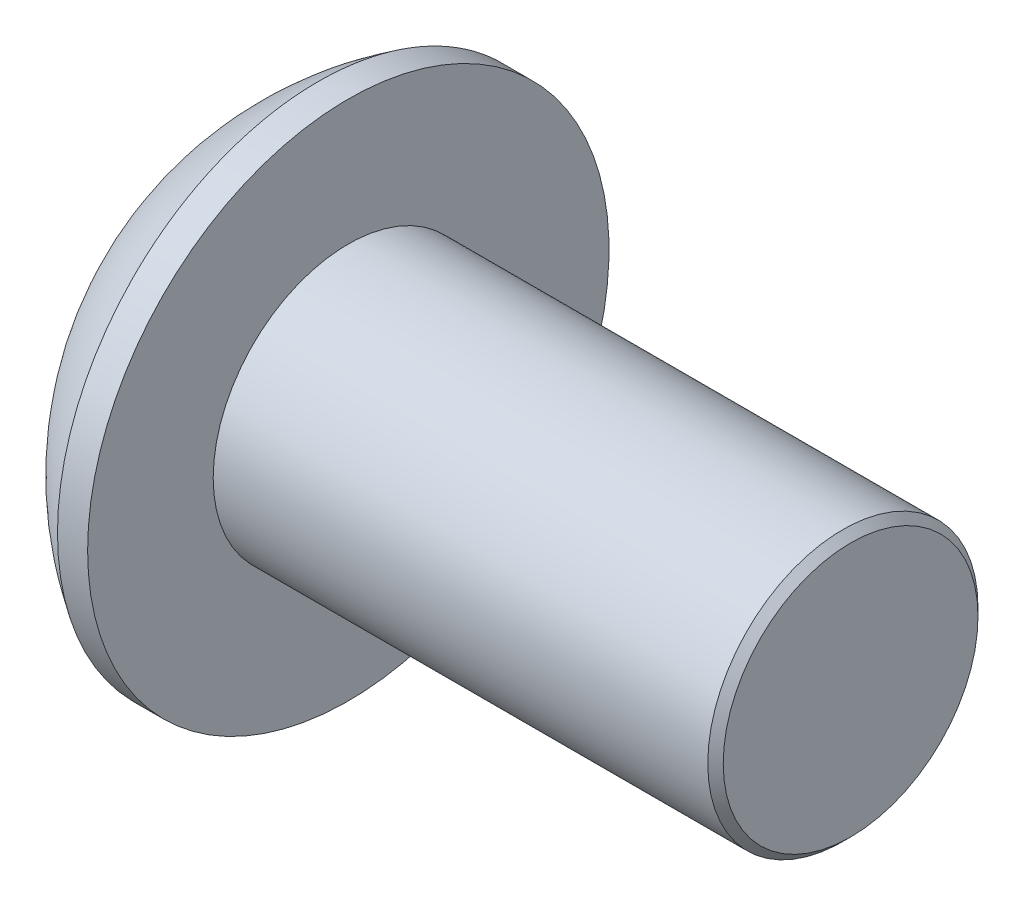
ISO-10303-21;
HEADER;
FILE_DESCRIPTION(('STEP AP214'),'2;1');
FILE_NAME('part.step','',(''),(''),'','','');
FILE_SCHEMA(('AUTOMOTIVE_DESIGN { 1 0 10303 214 1 1 1 1 }'));
ENDSEC;
DATA;
#1=APPLICATION_CONTEXT('core data for automotive mechanical design processes');
#2=APPLICATION_PROTOCOL_DEFINITION('international standard','automotive_design',2000,#1);
#3=PRODUCT_CONTEXT('',#1,'mechanical');
#4=PRODUCT('Part','Part','',(#3));
#5=PRODUCT_RELATED_PRODUCT_CATEGORY('part','',(#4));
#6=PRODUCT_DEFINITION_FORMATION('','',#4);
#7=PRODUCT_DEFINITION_CONTEXT('part definition',#1,'design');
#8=PRODUCT_DEFINITION('design','',#6,#7);
#9=PRODUCT_DEFINITION_SHAPE('','',#8);
#10=(LENGTH_UNIT() NAMED_UNIT(*) SI_UNIT(.MILLI.,.METRE.));
#11=(NAMED_UNIT(*) PLANE_ANGLE_UNIT() SI_UNIT($,.RADIAN.));
#12=(NAMED_UNIT(*) SI_UNIT($,.STERADIAN.) SOLID_ANGLE_UNIT());
#13=UNCERTAINTY_MEASURE_WITH_UNIT(LENGTH_MEASURE(1.E-05),#10,'distance_accuracy_value','');
#14=(GEOMETRIC_REPRESENTATION_CONTEXT(3) GLOBAL_UNCERTAINTY_ASSIGNED_CONTEXT((#13)) GLOBAL_UNIT_ASSIGNED_CONTEXT((#10,
#11,#12)) REPRESENTATION_CONTEXT('',''));
#15=CARTESIAN_POINT('',(0.,0.,0.));
#16=DIRECTION('',(0.,0.,1.));
#17=DIRECTION('',(1.,0.,0.));
#18=AXIS2_PLACEMENT_3D('',#15,#16,#17);
#19=CARTESIAN_POINT('',(1.32080000000034,0.,0.));
#20=DIRECTION('',(-1.,0.,0.));
#21=DIRECTION('',(0.,0.,1.));
#22=AXIS2_PLACEMENT_3D('',#19,#20,#21);
#23=CONICAL_SURFACE('',#22,1.1937999999998,1.04719755119608);
#24=CARTESIAN_POINT('',(2.01004075135902,0.,4.44089209850063E-13));
#25=VERTEX_POINT('',#24);
#26=VERTEX_LOOP('',#25);
#27=FACE_BOUND('',#26,.T.);
#28=CARTESIAN_POINT('',(1.32080000000009,0.,0.));
#29=DIRECTION('',(-1.,0.,0.));
#30=DIRECTION('',(0.,0.,1.));
#31=AXIS2_PLACEMENT_3D('',#28,#29,#30);
#32=CIRCLE('',#31,1.19380000000024);
#33=CARTESIAN_POINT('',(1.32080000000004,-1.03386112703797,0.59690000000006));
#34=VERTEX_POINT('',#33);
#35=CARTESIAN_POINT('',(1.32080000000004,0.,1.19380000000012));
#36=VERTEX_POINT('',#35);
#37=EDGE_CURVE('E19',#34,#36,#32,.T.);
#38=ORIENTED_EDGE('',*,*,#37,.T.);
#39=CARTESIAN_POINT('',(1.32080000000009,0.,0.));
#40=DIRECTION('',(-1.,0.,0.));
#41=DIRECTION('',(0.,0.,1.));
#42=AXIS2_PLACEMENT_3D('',#39,#40,#41);
#43=CIRCLE('',#42,1.19380000000024);
#44=CARTESIAN_POINT('',(1.32080000000004,1.03386112703797,0.596900000000061));
#45=VERTEX_POINT('',#44);
#46=EDGE_CURVE('E147',#36,#45,#43,.T.);
#47=ORIENTED_EDGE('',*,*,#46,.T.);
#48=CARTESIAN_POINT('',(1.32080000000009,0.,0.));
#49=DIRECTION('',(-1.,0.,0.));
#50=DIRECTION('',(0.,0.,1.));
#51=AXIS2_PLACEMENT_3D('',#48,#49,#50);
#52=CIRCLE('',#51,1.19380000000024);
#53=CARTESIAN_POINT('',(1.32080000000004,1.03386112703797,-0.596900000000061));
#54=VERTEX_POINT('',#53);
#55=EDGE_CURVE('E449',#45,#54,#52,.T.);
#56=ORIENTED_EDGE('',*,*,#55,.T.);
#57=CARTESIAN_POINT('',(1.32080000000009,0.,0.));
#58=DIRECTION('',(-1.,0.,0.));
#59=DIRECTION('',(0.,0.,1.));
#60=AXIS2_PLACEMENT_3D('',#57,#58,#59);
#61=CIRCLE('',#60,1.19380000000024);
#62=CARTESIAN_POINT('',(1.32080000000004,1.49457637585666E-12,-1.19380000000012));
#63=VERTEX_POINT('',#62);
#64=EDGE_CURVE('E450',#54,#63,#61,.T.);
#65=ORIENTED_EDGE('',*,*,#64,.T.);
#66=CARTESIAN_POINT('',(1.32080000000009,0.,0.));
#67=DIRECTION('',(-1.,0.,0.));
#68=DIRECTION('',(0.,0.,1.));
#69=AXIS2_PLACEMENT_3D('',#66,#67,#68);
#70=CIRCLE('',#69,1.19380000000024);
#71=CARTESIAN_POINT('',(1.32080000000004,-1.03386112703797,-0.596900000000061));
#72=VERTEX_POINT('',#71);
#73=EDGE_CURVE('E92',#63,#72,#70,.T.);
#74=ORIENTED_EDGE('',*,*,#73,.T.);
#75=CARTESIAN_POINT('',(1.32080000000009,0.,0.));
#76=DIRECTION('',(-1.,0.,0.));
#77=DIRECTION('',(0.,0.,1.));
#78=AXIS2_PLACEMENT_3D('',#75,#76,#77);
#79=CIRCLE('',#78,1.19380000000024);
#80=EDGE_CURVE('E88',#72,#34,#79,.T.);
#81=ORIENTED_EDGE('',*,*,#80,.T.);
#82=EDGE_LOOP('',(#38,#47,#56,#65,#74,#81));
#83=FACE_BOUND('',#82,.T.);
#84=ADVANCED_FACE('F16',(#27,#83),#23,.F.);
#85=CARTESIAN_POINT('',(1.3208,-2.06772225407573,-1.1938));
#86=DIRECTION('',(1.,0.,0.));
#87=DIRECTION('',(0.,0.,-1.));
#88=AXIS2_PLACEMENT_3D('',#85,#86,#87);
#89=PLANE('',#88);
#90=DIRECTION('',(0.,0.5,0.866025403784439));
#91=VECTOR('',#90,1.);
#92=CARTESIAN_POINT('',(1.3208,-1.37848150271715,0.));
#93=LINE('',#92,#91);
#94=CARTESIAN_POINT('',(1.3208,-0.689240751358575,1.1938));
#95=VERTEX_POINT('',#94);
#96=EDGE_CURVE('E100',#95,#34,#93,.F.);
#97=ORIENTED_EDGE('',*,*,#96,.F.);
#98=DIRECTION('',(0.,1.,0.));
#99=VECTOR('',#98,1.);
#100=CARTESIAN_POINT('',(1.3208,-0.689240751358575,1.1938));
#101=LINE('',#100,#99);
#102=EDGE_CURVE('E102',#36,#95,#101,.F.);
#103=ORIENTED_EDGE('',*,*,#102,.F.);
#104=ORIENTED_EDGE('',*,*,#37,.F.);
#105=EDGE_LOOP('',(#97,#103,#104));
#106=FACE_BOUND('',#105,.T.);
#107=ADVANCED_FACE('F98',(#106),#89,.F.);
#108=CARTESIAN_POINT('',(1.3208,-2.06772225407573,-1.1938));
#109=DIRECTION('',(1.,0.,0.));
#110=DIRECTION('',(0.,0.,-1.));
#111=AXIS2_PLACEMENT_3D('',#108,#109,#110);
#112=PLANE('',#111);
#113=DIRECTION('',(0.,-0.5,0.866025403784439));
#114=VECTOR('',#113,1.);
#115=CARTESIAN_POINT('',(1.3208,-0.689240751358575,-1.1938));
#116=LINE('',#115,#114);
#117=CARTESIAN_POINT('',(1.3208,-1.37848150271715,0.));
#118=VERTEX_POINT('',#117);
#119=EDGE_CURVE('E108',#118,#72,#116,.F.);
#120=ORIENTED_EDGE('',*,*,#119,.F.);
#121=DIRECTION('',(0.,0.5,0.866025403784439));
#122=VECTOR('',#121,1.);
#123=CARTESIAN_POINT('',(1.3208,-1.37848150271715,0.));
#124=LINE('',#123,#122);
#125=EDGE_CURVE('E105',#34,#118,#124,.F.);
#126=ORIENTED_EDGE('',*,*,#125,.F.);
#127=ORIENTED_EDGE('',*,*,#80,.F.);
#128=EDGE_LOOP('',(#120,#126,#127));
#129=FACE_BOUND('',#128,.T.);
#130=ADVANCED_FACE('F106',(#129),#112,.F.);
#131=CARTESIAN_POINT('',(1.3208,-2.06772225407573,-1.1938));
#132=DIRECTION('',(1.,0.,0.));
#133=DIRECTION('',(0.,0.,-1.));
#134=AXIS2_PLACEMENT_3D('',#131,#132,#133);
#135=PLANE('',#134);
#136=DIRECTION('',(0.,1.,0.));
#137=VECTOR('',#136,1.);
#138=CARTESIAN_POINT('',(1.3208,0.689240751358575,-1.1938));
#139=LINE('',#138,#137);
#140=CARTESIAN_POINT('',(1.3208,-0.689240751358575,-1.1938));
#141=VERTEX_POINT('',#140);
#142=EDGE_CURVE('E420',#141,#63,#139,.T.);
#143=ORIENTED_EDGE('',*,*,#142,.F.);
#144=DIRECTION('',(0.,-0.5,0.866025403784439));
#145=VECTOR('',#144,1.);
#146=CARTESIAN_POINT('',(1.3208,-0.689240751358575,-1.1938));
#147=LINE('',#146,#145);
#148=EDGE_CURVE('E432',#72,#141,#147,.F.);
#149=ORIENTED_EDGE('',*,*,#148,.F.);
#150=ORIENTED_EDGE('',*,*,#73,.F.);
#151=EDGE_LOOP('',(#143,#149,#150));
#152=FACE_BOUND('',#151,.T.);
#153=ADVANCED_FACE('F190',(#152),#135,.F.);
#154=CARTESIAN_POINT('',(1.3208,-2.06772225407573,-1.1938));
#155=DIRECTION('',(1.,0.,0.));
#156=DIRECTION('',(0.,0.,-1.));
#157=AXIS2_PLACEMENT_3D('',#154,#155,#156);
#158=PLANE('',#157);
#159=DIRECTION('',(0.,-0.5,-0.866025403784439));
#160=VECTOR('',#159,1.);
#161=CARTESIAN_POINT('',(1.3208,1.37848150271715,0.));
#162=LINE('',#161,#160);
#163=CARTESIAN_POINT('',(1.3208,0.689240751358575,-1.1938));
#164=VERTEX_POINT('',#163);
#165=EDGE_CURVE('E406',#164,#54,#162,.F.);
#166=ORIENTED_EDGE('',*,*,#165,.F.);
#167=DIRECTION('',(0.,1.,0.));
#168=VECTOR('',#167,1.);
#169=CARTESIAN_POINT('',(1.3208,0.689240751358575,-1.1938));
#170=LINE('',#169,#168);
#171=EDGE_CURVE('E417',#63,#164,#170,.T.);
#172=ORIENTED_EDGE('',*,*,#171,.F.);
#173=ORIENTED_EDGE('',*,*,#64,.F.);
#174=EDGE_LOOP('',(#166,#172,#173));
#175=FACE_BOUND('',#174,.T.);
#176=ADVANCED_FACE('F186',(#175),#158,.F.);
#177=CARTESIAN_POINT('',(1.3208,-2.06772225407573,-1.1938));
#178=DIRECTION('',(1.,0.,0.));
#179=DIRECTION('',(0.,0.,-1.));
#180=AXIS2_PLACEMENT_3D('',#177,#178,#179);
#181=PLANE('',#180);
#182=DIRECTION('',(0.,0.5,-0.866025403784439));
#183=VECTOR('',#182,1.);
#184=CARTESIAN_POINT('',(1.3208,0.689240751358575,1.1938));
#185=LINE('',#184,#183);
#186=CARTESIAN_POINT('',(1.3208,1.37848150271715,0.));
#187=VERTEX_POINT('',#186);
#188=EDGE_CURVE('E385',#187,#45,#185,.F.);
#189=ORIENTED_EDGE('',*,*,#188,.F.);
#190=DIRECTION('',(0.,-0.5,-0.866025403784439));
#191=VECTOR('',#190,1.);
#192=CARTESIAN_POINT('',(1.3208,1.37848150271715,0.));
#193=LINE('',#192,#191);
#194=EDGE_CURVE('E404',#54,#187,#193,.F.);
#195=ORIENTED_EDGE('',*,*,#194,.F.);
#196=ORIENTED_EDGE('',*,*,#55,.F.);
#197=EDGE_LOOP('',(#189,#195,#196));
#198=FACE_BOUND('',#197,.T.);
#199=ADVANCED_FACE('F182',(#198),#181,.F.);
#200=CARTESIAN_POINT('',(1.3208,-2.06772225407573,-1.1938));
#201=DIRECTION('',(1.,0.,0.));
#202=DIRECTION('',(0.,0.,-1.));
#203=AXIS2_PLACEMENT_3D('',#200,#201,#202);
#204=PLANE('',#203);
#205=DIRECTION('',(0.,1.,0.));
#206=VECTOR('',#205,1.);
#207=CARTESIAN_POINT('',(1.3208,-0.689240751358575,1.1938));
#208=LINE('',#207,#206);
#209=CARTESIAN_POINT('',(1.3208,0.689240751358575,1.1938));
#210=VERTEX_POINT('',#209);
#211=EDGE_CURVE('E117',#210,#36,#208,.F.);
#212=ORIENTED_EDGE('',*,*,#211,.F.);
#213=DIRECTION('',(0.,0.5,-0.866025403784439));
#214=VECTOR('',#213,1.);
#215=CARTESIAN_POINT('',(1.3208,0.689240751358575,1.1938));
#216=LINE('',#215,#214);
#217=EDGE_CURVE('E388',#45,#210,#216,.F.);
#218=ORIENTED_EDGE('',*,*,#217,.F.);
#219=ORIENTED_EDGE('',*,*,#46,.F.);
#220=EDGE_LOOP('',(#212,#218,#219));
#221=FACE_BOUND('',#220,.T.);
#222=ADVANCED_FACE('F178',(#221),#204,.F.);
#223=CARTESIAN_POINT('',(1.3208,-0.689240751358575,1.1938));
#224=DIRECTION('',(0.,0.,-1.));
#225=DIRECTION('',(0.,1.,0.));
#226=AXIS2_PLACEMENT_3D('',#223,#224,#225);
#227=PLANE('',#226);
#228=DIRECTION('',(0.,1.,0.));
#229=VECTOR('',#228,1.);
#230=CARTESIAN_POINT('',(0.,0.,1.1938));
#231=LINE('',#230,#229);
#232=CARTESIAN_POINT('',(0.,0.689240751358575,1.1938));
#233=VERTEX_POINT('',#232);
#234=CARTESIAN_POINT('',(0.,-0.689240751358575,1.1938));
#235=VERTEX_POINT('',#234);
#236=EDGE_CURVE('E382',#233,#235,#231,.F.);
#237=ORIENTED_EDGE('',*,*,#236,.F.);
#238=DIRECTION('',(1.,0.,0.));
#239=VECTOR('',#238,1.);
#240=CARTESIAN_POINT('',(1.3208,0.689240751358575,1.1938));
#241=LINE('',#240,#239);
#242=EDGE_CURVE('E394',#210,#233,#241,.F.);
#243=ORIENTED_EDGE('',*,*,#242,.F.);
#244=ORIENTED_EDGE('',*,*,#211,.T.);
#245=ORIENTED_EDGE('',*,*,#102,.T.);
#246=DIRECTION('',(1.,0.,0.));
#247=VECTOR('',#246,1.);
#248=CARTESIAN_POINT('',(1.3208,-0.689240751358575,1.1938));
#249=LINE('',#248,#247);
#250=EDGE_CURVE('E111',#235,#95,#249,.T.);
#251=ORIENTED_EDGE('',*,*,#250,.F.);
#252=EDGE_LOOP('',(#237,#243,#244,#245,#251));
#253=FACE_BOUND('',#252,.T.);
#254=ADVANCED_FACE('F175',(#253),#227,.T.);
#255=CARTESIAN_POINT('',(1.3208,-1.37848150271715,0.));
#256=DIRECTION('',(0.,0.866025403784439,-0.5));
#257=DIRECTION('',(0.,0.5,0.866025403784439));
#258=AXIS2_PLACEMENT_3D('',#255,#256,#257);
#259=PLANE('',#258);
#260=DIRECTION('',(0.,-0.5,-0.866025403784439));
#261=VECTOR('',#260,1.);
#262=CARTESIAN_POINT('',(0.,-0.689240751358575,1.1938));
#263=LINE('',#262,#261);
#264=CARTESIAN_POINT('',(0.,-1.37848150271715,0.));
#265=VERTEX_POINT('',#264);
#266=EDGE_CURVE('E379',#235,#265,#263,.T.);
#267=ORIENTED_EDGE('',*,*,#266,.F.);
#268=ORIENTED_EDGE('',*,*,#250,.T.);
#269=ORIENTED_EDGE('',*,*,#96,.T.);
#270=ORIENTED_EDGE('',*,*,#125,.T.);
#271=DIRECTION('',(1.,0.,0.));
#272=VECTOR('',#271,1.);
#273=CARTESIAN_POINT('',(1.3208,-1.37848150271715,0.));
#274=LINE('',#273,#272);
#275=EDGE_CURVE('E429',#265,#118,#274,.T.);
#276=ORIENTED_EDGE('',*,*,#275,.F.);
#277=EDGE_LOOP('',(#267,#268,#269,#270,#276));
#278=FACE_BOUND('',#277,.T.);
#279=ADVANCED_FACE('F115',(#278),#259,.T.);
#280=CARTESIAN_POINT('',(1.3208,-0.689240751358575,-1.1938));
#281=DIRECTION('',(0.,0.866025403784439,0.5));
#282=DIRECTION('',(0.,-0.5,0.866025403784439));
#283=AXIS2_PLACEMENT_3D('',#280,#281,#282);
#284=PLANE('',#283);
#285=DIRECTION('',(0.,0.5,-0.866025403784439));
#286=VECTOR('',#285,1.);
#287=CARTESIAN_POINT('',(0.,-1.37848150271715,0.));
#288=LINE('',#287,#286);
#289=CARTESIAN_POINT('',(0.,-0.689240751358575,-1.1938));
#290=VERTEX_POINT('',#289);
#291=EDGE_CURVE('E376',#265,#290,#288,.T.);
#292=ORIENTED_EDGE('',*,*,#291,.F.);
#293=ORIENTED_EDGE('',*,*,#275,.T.);
#294=ORIENTED_EDGE('',*,*,#119,.T.);
#295=ORIENTED_EDGE('',*,*,#148,.T.);
#296=DIRECTION('',(1.,0.,0.));
#297=VECTOR('',#296,1.);
#298=CARTESIAN_POINT('',(1.3208,-0.689240751358575,-1.1938));
#299=LINE('',#298,#297);
#300=EDGE_CURVE('E414',#290,#141,#299,.T.);
#301=ORIENTED_EDGE('',*,*,#300,.F.);
#302=EDGE_LOOP('',(#292,#293,#294,#295,#301));
#303=FACE_BOUND('',#302,.T.);
#304=ADVANCED_FACE('F168',(#303),#284,.T.);
#305=CARTESIAN_POINT('',(1.3208,0.689240751358575,-1.1938));
#306=DIRECTION('',(0.,0.,1.));
#307=DIRECTION('',(1.,0.,0.));
#308=AXIS2_PLACEMENT_3D('',#305,#306,#307);
#309=PLANE('',#308);
#310=DIRECTION('',(0.,1.,0.));
#311=VECTOR('',#310,1.);
#312=CARTESIAN_POINT('',(0.,0.,-1.1938));
#313=LINE('',#312,#311);
#314=CARTESIAN_POINT('',(0.,0.689240751358575,-1.1938));
#315=VERTEX_POINT('',#314);
#316=EDGE_CURVE('E373',#290,#315,#313,.T.);
#317=ORIENTED_EDGE('',*,*,#316,.F.);
#318=ORIENTED_EDGE('',*,*,#300,.T.);
#319=ORIENTED_EDGE('',*,*,#142,.T.);
#320=ORIENTED_EDGE('',*,*,#171,.T.);
#321=DIRECTION('',(1.,0.,0.));
#322=VECTOR('',#321,1.);
#323=CARTESIAN_POINT('',(1.3208,0.689240751358575,-1.1938));
#324=LINE('',#323,#322);
#325=EDGE_CURVE('E389',#315,#164,#324,.T.);
#326=ORIENTED_EDGE('',*,*,#325,.F.);
#327=EDGE_LOOP('',(#317,#318,#319,#320,#326));
#328=FACE_BOUND('',#327,.T.);
#329=ADVANCED_FACE('F165',(#328),#309,.T.);
#330=CARTESIAN_POINT('',(1.3208,1.37848150271715,0.));
#331=DIRECTION('',(0.,-0.866025403784439,0.5));
#332=DIRECTION('',(0.,-0.5,-0.866025403784439));
#333=AXIS2_PLACEMENT_3D('',#330,#331,#332);
#334=PLANE('',#333);
#335=DIRECTION('',(0.,0.5,0.866025403784439));
#336=VECTOR('',#335,1.);
#337=CARTESIAN_POINT('',(0.,0.689240751358575,-1.1938));
#338=LINE('',#337,#336);
#339=CARTESIAN_POINT('',(0.,1.37848150271715,0.));
#340=VERTEX_POINT('',#339);
#341=EDGE_CURVE('E370',#315,#340,#338,.T.);
#342=ORIENTED_EDGE('',*,*,#341,.F.);
#343=ORIENTED_EDGE('',*,*,#325,.T.);
#344=ORIENTED_EDGE('',*,*,#165,.T.);
#345=ORIENTED_EDGE('',*,*,#194,.T.);
#346=DIRECTION('',(1.,0.,0.));
#347=VECTOR('',#346,1.);
#348=CARTESIAN_POINT('',(1.3208,1.37848150271715,0.));
#349=LINE('',#348,#347);
#350=EDGE_CURVE('E34',#340,#187,#349,.T.);
#351=ORIENTED_EDGE('',*,*,#350,.F.);
#352=EDGE_LOOP('',(#342,#343,#344,#345,#351));
#353=FACE_BOUND('',#352,.T.);
#354=ADVANCED_FACE('F161',(#353),#334,.T.);
#355=CARTESIAN_POINT('',(1.3208,0.689240751358575,1.1938));
#356=DIRECTION('',(0.,-0.866025403784439,-0.5));
#357=DIRECTION('',(0.,0.5,-0.866025403784439));
#358=AXIS2_PLACEMENT_3D('',#355,#356,#357);
#359=PLANE('',#358);
#360=DIRECTION('',(0.,-0.5,0.866025403784439));
#361=VECTOR('',#360,1.);
#362=CARTESIAN_POINT('',(0.,1.37848150271715,0.));
#363=LINE('',#362,#361);
#364=EDGE_CURVE('E146',#340,#233,#363,.T.);
#365=ORIENTED_EDGE('',*,*,#364,.F.);
#366=ORIENTED_EDGE('',*,*,#350,.T.);
#367=ORIENTED_EDGE('',*,*,#188,.T.);
#368=ORIENTED_EDGE('',*,*,#217,.T.);
#369=ORIENTED_EDGE('',*,*,#242,.T.);
#370=EDGE_LOOP('',(#365,#366,#367,#368,#369));
#371=FACE_BOUND('',#370,.T.);
#372=ADVANCED_FACE('F157',(#371),#359,.T.);
#373=CARTESIAN_POINT('',(0.,0.,0.));
#374=DIRECTION('',(-1.,0.,0.));
#375=DIRECTION('',(0.,0.,1.));
#376=AXIS2_PLACEMENT_3D('',#373,#374,#375);
#377=PLANE('',#376);
#378=ORIENTED_EDGE('',*,*,#341,.T.);
#379=ORIENTED_EDGE('',*,*,#364,.T.);
#380=ORIENTED_EDGE('',*,*,#236,.T.);
#381=ORIENTED_EDGE('',*,*,#266,.T.);
#382=ORIENTED_EDGE('',*,*,#291,.T.);
#383=ORIENTED_EDGE('',*,*,#316,.T.);
#384=EDGE_LOOP('',(#378,#379,#380,#381,#382,#383));
#385=FACE_BOUND('',#384,.T.);
#386=CARTESIAN_POINT('',(0.,1.647825,0.));
#387=CARTESIAN_POINT('',(1.63519156892115E-13,1.64781976319874,0.0924902039777532));
#388=CARTESIAN_POINT('',(1.3280260282674E-13,1.63999511633709,0.18514501432637));
#389=CARTESIAN_POINT('',(0.,1.6167119250047,0.322075808080014));
#390=CARTESIAN_POINT('',(-1.58318794569898E-13,1.60700618770234,0.367435533396361));
#391=CARTESIAN_POINT('',(1.5888139631505E-13,1.58380101865853,0.457220935695141));
#392=CARTESIAN_POINT('',(5.68557833423821E-13,1.57029850831031,0.501645823115264));
#393=CARTESIAN_POINT('',(9.3616121179063E-13,1.52428156574313,0.632817459278968));
#394=CARTESIAN_POINT('',(0.,1.48621992666366,0.717681965518643));
#395=CARTESIAN_POINT('',(0.,1.39637079695658,0.879809706624016));
#396=CARTESIAN_POINT('',(7.82242536497637E-13,1.34458278455109,0.957072652379996));
#397=CARTESIAN_POINT('',(4.86953568155855E-13,1.25777784714522,1.06558770210238));
#398=CARTESIAN_POINT('',(1.33447060642817E-13,1.22729946114794,1.10054993332365));
#399=CARTESIAN_POINT('',(-1.32884925775019E-13,1.16354004969107,1.16775237388221));
#400=CARTESIAN_POINT('',(0.,1.13026175473033,1.19999517515816));
#401=CARTESIAN_POINT('',(0.,1.02649304340867,1.29236218866442));
#402=CARTESIAN_POINT('',(0.,0.952049986714079,1.34814848277713));
#403=CARTESIAN_POINT('',(0.,0.794895196754069,1.44639825105766));
#404=CARTESIAN_POINT('',(0.,0.712183775431297,1.48886222758992));
#405=CARTESIAN_POINT('',(0.,0.54079662426573,1.55930919813143));
#406=CARTESIAN_POINT('',(0.,0.452120958135286,1.58729234680269));
#407=CARTESIAN_POINT('',(0.,0.271332331080317,1.62797191307414));
#408=CARTESIAN_POINT('',(0.,0.179219351801789,1.64066824903626));
#409=CARTESIAN_POINT('',(0.,-0.00583077027840882,1.65041748705409));
#410=CARTESIAN_POINT('',(0.,-0.0987679130800783,1.64747038910979));
#411=CARTESIAN_POINT('',(0.,-0.282830196388826,1.62601274134436));
#412=CARTESIAN_POINT('',(0.,-0.37395534657002,1.60750227463794));
#413=CARTESIAN_POINT('',(0.,-0.551796068178806,1.55545413364524));
#414=CARTESIAN_POINT('',(0.,-0.638511592498167,1.52191629885844));
#415=CARTESIAN_POINT('',(0.,-0.805120175533155,1.44072378052347));
#416=CARTESIAN_POINT('',(0.,-0.885012976819958,1.39306856461393));
#417=CARTESIAN_POINT('',(0.,-0.997912879588362,1.31211658756413));
#418=CARTESIAN_POINT('',(0.,-1.0343949246834,1.28354906167735));
#419=CARTESIAN_POINT('',(0.,-1.10486279842069,1.2234182930371));
#420=CARTESIAN_POINT('',(0.,-1.13884618403291,1.19185218578118));
#421=CARTESIAN_POINT('',(0.,-1.23657300939909,1.09305906467359));
#422=CARTESIAN_POINT('',(0.,-1.29619288399357,1.02166556658613));
#423=CARTESIAN_POINT('',(0.,-1.40258050817756,0.869876423478036));
#424=CARTESIAN_POINT('',(0.,-1.44934874627767,0.789481120793481));
#425=CARTESIAN_POINT('',(0.,-1.50889406070376,0.663870959313344));
#426=CARTESIAN_POINT('',(0.,-1.52698985473587,0.621110806760431));
#427=CARTESIAN_POINT('',(0.,-1.55950093966665,0.534260776864334));
#428=CARTESIAN_POINT('',(-1.04973140146496E-13,-1.57391920916438,0.490172008203172));
#429=CARTESIAN_POINT('',(2.10045254706393E-13,-1.6114617790958,0.356445777718599));
#430=CARTESIAN_POINT('',(1.14250083706093E-12,-1.62897899568075,0.265126085962908));
#431=CARTESIAN_POINT('',(4.34054466733687E-13,-1.64174347214909,0.144386595969389));
#432=CARTESIAN_POINT('',(1.21340306256601E-13,-1.64402207668917,0.115560405797875));
#433=CARTESIAN_POINT('',(-1.20906625387681E-13,-1.64706365940121,0.0578281757252701));
#434=CARTESIAN_POINT('',(0.,-1.64782663757319,0.0289221358241782));
#435=CARTESIAN_POINT('',(1.64941431812562E-13,-1.64781976319875,-0.0924902039777541));
#436=CARTESIAN_POINT('',(1.33069267383729E-13,-1.6399951163371,-0.185145014326371));
#437=CARTESIAN_POINT('',(0.,-1.61671192500471,-0.322075808080015));
#438=CARTESIAN_POINT('',(-1.58362753759592E-13,-1.60700618770235,-0.367435533396362));
#439=CARTESIAN_POINT('',(1.58925391252273E-13,-1.58380101865854,-0.457220935695142));
#440=CARTESIAN_POINT('',(5.68599984465805E-13,-1.57029850831032,-0.501645823115265));
#441=CARTESIAN_POINT('',(9.360771106357E-13,-1.52428156574314,-0.632817459278968));
#442=CARTESIAN_POINT('',(0.,-1.48621992666367,-0.717681965518644));
#443=CARTESIAN_POINT('',(0.,-1.39637079695659,-0.879809706624018));
#444=CARTESIAN_POINT('',(7.83473156940465E-13,-1.3445827845511,-0.957072652379998));
#445=CARTESIAN_POINT('',(4.87639062539118E-13,-1.25777784714523,-1.06558770210238));
#446=CARTESIAN_POINT('',(1.33633557334351E-13,-1.22729946114795,-1.10054993332365));
#447=CARTESIAN_POINT('',(-1.33071242655653E-13,-1.16354004969107,-1.16775237388221));
#448=CARTESIAN_POINT('',(0.,-1.13026175473034,-1.19999517515816));
#449=CARTESIAN_POINT('',(0.,-1.02649304340868,-1.29236218866442));
#450=CARTESIAN_POINT('',(0.,-0.95204998671409,-1.34814848277713));
#451=CARTESIAN_POINT('',(0.,-0.79489519675408,-1.44639825105766));
#452=CARTESIAN_POINT('',(0.,-0.712183775431308,-1.48886222758992));
#453=CARTESIAN_POINT('',(0.,-0.540796624265741,-1.55930919813143));
#454=CARTESIAN_POINT('',(0.,-0.452120958135297,-1.58729234680269));
#455=CARTESIAN_POINT('',(0.,-0.271332331080327,-1.62797191307414));
#456=CARTESIAN_POINT('',(0.,-0.179219351801799,-1.64066824903626));
#457=CARTESIAN_POINT('',(0.,0.00583077027839878,-1.65041748705409));
#458=CARTESIAN_POINT('',(0.,0.0987679130800683,-1.64747038910979));
#459=CARTESIAN_POINT('',(0.,0.282830196388816,-1.62601274134436));
#460=CARTESIAN_POINT('',(0.,0.37395534657001,-1.60750227463795));
#461=CARTESIAN_POINT('',(0.,0.551796068178796,-1.55545413364524));
#462=CARTESIAN_POINT('',(0.,0.638511592498158,-1.52191629885844));
#463=CARTESIAN_POINT('',(0.,0.805120175533146,-1.44072378052347));
#464=CARTESIAN_POINT('',(0.,0.885012976819948,-1.39306856461394));
#465=CARTESIAN_POINT('',(0.,0.997912879588351,-1.31211658756413));
#466=CARTESIAN_POINT('',(0.,1.03439492468339,-1.28354906167735));
#467=CARTESIAN_POINT('',(0.,1.10486279842068,-1.2234182930371));
#468=CARTESIAN_POINT('',(0.,1.1388461840329,-1.19185218578118));
#469=CARTESIAN_POINT('',(0.,1.23657300939908,-1.09305906467359));
#470=CARTESIAN_POINT('',(0.,1.29619288399356,-1.02166556658613));
#471=CARTESIAN_POINT('',(0.,1.40258050817755,-0.869876423478035));
#472=CARTESIAN_POINT('',(0.,1.44934874627766,-0.789481120793481));
#473=CARTESIAN_POINT('',(0.,1.50889406070375,-0.663870959313343));
#474=CARTESIAN_POINT('',(0.,1.52698985473586,-0.62111080676043));
#475=CARTESIAN_POINT('',(0.,1.55950093966664,-0.534260776864333));
#476=CARTESIAN_POINT('',(-1.0525400134382E-13,1.57391920916438,-0.49017200820317));
#477=CARTESIAN_POINT('',(2.10605504450137E-13,1.61146177909579,-0.356445777718598));
#478=CARTESIAN_POINT('',(1.14555106174587E-12,1.62897899568074,-0.265126085962907));
#479=CARTESIAN_POINT('',(4.3537782659486E-13,1.64174347214909,-0.144386595969388));
#480=CARTESIAN_POINT('',(1.21880186581217E-13,1.64402207668916,-0.115560405797875));
#481=CARTESIAN_POINT('',(-1.21446505712297E-13,1.6470636594012,-0.0578281757252703));
#482=CARTESIAN_POINT('',(0.,1.64782663757318,-0.0289221358241787));
#483=CARTESIAN_POINT('',(0.,1.647825,0.));
#484=B_SPLINE_CURVE_WITH_KNOTS('',3,(#386,#387,#388,#389,#390,#391,#392,#393,#394,#395,#396,
#397,#398,#399,#400,#401,#402,#403,#404,#405,#406,#407,#408,#409,#410,#411,#412,#413,#414,#415,
#416,#417,#418,#419,#420,#421,#422,#423,#424,#425,#426,#427,#428,#429,#430,#431,#432,#433,#434,
#435,#436,#437,#438,#439,#440,#441,#442,#443,#444,#445,#446,#447,#448,#449,#450,#451,#452,#453,
#454,#455,#456,#457,#458,#459,#460,#461,#462,#463,#464,#465,#466,#467,#468,#469,#470,#471,#472,
#473,#474,#475,#476,#477,#478,#479,#480,#481,#482,#483),.UNSPECIFIED.,.T.,.F.,(4,2,2,2,2,2,2,2,
2,2,2,2,2,2,2,2,2,2,2,2,2,2,2,2,2,2,2,2,2,2,2,2,2,2,2,2,2,2,2,2,2,2,2,2,2,2,2,2,4),(0.,
0.277336029422427,0.416368541537112,0.555514114625601,0.833141970294988,1.11078038089036,
1.24978149120748,1.38864858351854,1.66629367015056,1.94392828594775,2.22155993641642,
2.49919306954938,2.77682620268235,3.05445785315102,3.33209246894821,3.60973755557991,
3.74860464789075,3.88760575820768,4.16524416880333,4.44287202447289,4.58201759756162,
4.72105010967663,4.99838613909884,5.08511046196678,5.17183478483478,5.44917081425721,
5.58820332637189,5.72734889946038,6.00497675512977,6.28261516572515,6.42161627604226,
6.56048336835333,6.83812845498534,7.11576307078253,7.39339472125121,7.67102785438416,
7.94866098751713,8.2262926379858,8.50392725378299,8.78157234041469,8.92043943272553,
9.05944054304246,9.33707895363812,9.61470680930767,9.7538523823964,9.89288489451142,
10.1702209239336,10.2569452468016,10.3436695696696),.UNSPECIFIED.);
#485=CARTESIAN_POINT('',(0.,1.647825,0.));
#486=VERTEX_POINT('',#485);
#487=EDGE_CURVE('E139',#486,#486,#484,.T.);
#488=ORIENTED_EDGE('',*,*,#487,.F.);
#489=EDGE_LOOP('',(#488));
#490=FACE_BOUND('',#489,.T.);
#491=ADVANCED_FACE('F153',(#385,#490),#377,.T.);
#492=CARTESIAN_POINT('',(3.50132362607759,0.,0.));
#493=DIRECTION('',(0.,1.,0.));
#494=DIRECTION('',(1.,0.,0.));
#495=AXIS2_PLACEMENT_3D('',#492,#493,#494);
#496=SPHERICAL_SURFACE('',#495,3.86970210289554);
#497=CARTESIAN_POINT('',(1.4732,0.,0.));
#498=DIRECTION('',(-1.,0.,0.));
#499=DIRECTION('',(0.,0.,1.));
#500=AXIS2_PLACEMENT_3D('',#497,#498,#499);
#501=CIRCLE('',#500,3.29565);
#502=CARTESIAN_POINT('',(1.4732,0.,3.29565));
#503=VERTEX_POINT('',#502);
#504=EDGE_CURVE('E136',#503,#503,#501,.F.);
#505=ORIENTED_EDGE('',*,*,#504,.F.);
#506=EDGE_LOOP('',(#505));
#507=FACE_BOUND('',#506,.T.);
#508=ORIENTED_EDGE('',*,*,#487,.T.);
#509=EDGE_LOOP('',(#508));
#510=FACE_BOUND('',#509,.T.);
#511=ADVANCED_FACE('F149',(#507,#510),#496,.T.);
#512=CARTESIAN_POINT('',(8.2042,0.,0.));
#513=DIRECTION('',(-1.,0.,0.));
#514=DIRECTION('',(0.,0.,1.));
#515=AXIS2_PLACEMENT_3D('',#512,#513,#514);
#516=PLANE('',#515);
#517=CARTESIAN_POINT('',(8.20420000002287,0.,0.));
#518=DIRECTION('',(-1.,0.,0.));
#519=DIRECTION('',(0.,0.,1.));
#520=AXIS2_PLACEMENT_3D('',#517,#518,#519);
#521=CIRCLE('',#520,1.61036000002923);
#522=CARTESIAN_POINT('',(8.20420000002287,0.,1.61036000002923));
#523=VERTEX_POINT('',#522);
#524=EDGE_CURVE('E133',#523,#523,#521,.T.);
#525=ORIENTED_EDGE('',*,*,#524,.F.);
#526=EDGE_LOOP('',(#525));
#527=FACE_BOUND('',#526,.T.);
#528=ADVANCED_FACE('F221',(#527),#516,.F.);
#529=CARTESIAN_POINT('',(0.,0.,0.));
#530=DIRECTION('',(-1.,0.,0.));
#531=DIRECTION('',(0.,0.,1.));
#532=AXIS2_PLACEMENT_3D('',#529,#530,#531);
#533=CYLINDRICAL_SURFACE('',#532,3.29565);
#534=ORIENTED_EDGE('',*,*,#504,.T.);
#535=EDGE_LOOP('',(#534));
#536=FACE_BOUND('',#535,.T.);
#537=CARTESIAN_POINT('',(1.8542,0.,0.));
#538=DIRECTION('',(-1.,0.,0.));
#539=DIRECTION('',(0.,0.,1.));
#540=AXIS2_PLACEMENT_3D('',#537,#538,#539);
#541=CIRCLE('',#540,3.29565);
#542=CARTESIAN_POINT('',(1.8542,0.,3.29565));
#543=VERTEX_POINT('',#542);
#544=EDGE_CURVE('E130',#543,#543,#541,.T.);
#545=ORIENTED_EDGE('',*,*,#544,.T.);
#546=EDGE_LOOP('',(#545));
#547=FACE_BOUND('',#546,.T.);
#548=ADVANCED_FACE('F218',(#536,#547),#533,.T.);
#549=CARTESIAN_POINT('',(8.10641000003898,0.,0.));
#550=DIRECTION('',(-1.,0.,0.));
#551=DIRECTION('',(0.,0.,1.));
#552=AXIS2_PLACEMENT_3D('',#549,#550,#551);
#553=CONICAL_SURFACE('',#552,1.70814999995628,0.785398163106808);
#554=CARTESIAN_POINT('',(8.10641000000005,0.,0.));
#555=DIRECTION('',(-1.,0.,0.));
#556=DIRECTION('',(0.,0.,1.));
#557=AXIS2_PLACEMENT_3D('',#554,#555,#556);
#558=CIRCLE('',#557,1.70814999999999);
#559=CARTESIAN_POINT('',(8.10641000000005,0.,1.70814999999999));
#560=VERTEX_POINT('',#559);
#561=EDGE_CURVE('E25',#560,#560,#558,.T.);
#562=ORIENTED_EDGE('',*,*,#561,.F.);
#563=EDGE_LOOP('',(#562));
#564=FACE_BOUND('',#563,.T.);
#565=ORIENTED_EDGE('',*,*,#524,.T.);
#566=EDGE_LOOP('',(#565));
#567=FACE_BOUND('',#566,.T.);
#568=ADVANCED_FACE('F211',(#564,#567),#553,.T.);
#569=CARTESIAN_POINT('',(1.8542,1.70814999999999,0.));
#570=DIRECTION('',(-1.,0.,0.));
#571=DIRECTION('',(0.,0.,1.));
#572=AXIS2_PLACEMENT_3D('',#569,#570,#571);
#573=PLANE('',#572);
#574=CARTESIAN_POINT('',(1.8542,0.,0.));
#575=DIRECTION('',(-1.,0.,0.));
#576=DIRECTION('',(0.,0.,1.));
#577=AXIS2_PLACEMENT_3D('',#574,#575,#576);
#578=CIRCLE('',#577,1.70814999999999);
#579=CARTESIAN_POINT('',(1.8542,0.,1.70814999999999));
#580=VERTEX_POINT('',#579);
#581=EDGE_CURVE('E11',#580,#580,#578,.F.);
#582=ORIENTED_EDGE('',*,*,#581,.F.);
#583=EDGE_LOOP('',(#582));
#584=FACE_BOUND('',#583,.T.);
#585=ORIENTED_EDGE('',*,*,#544,.F.);
#586=EDGE_LOOP('',(#585));
#587=FACE_BOUND('',#586,.T.);
#588=ADVANCED_FACE('F205',(#584,#587),#573,.F.);
#589=CARTESIAN_POINT('',(0.,0.,0.));
#590=DIRECTION('',(-1.,0.,0.));
#591=DIRECTION('',(0.,0.,1.));
#592=AXIS2_PLACEMENT_3D('',#589,#590,#591);
#593=CYLINDRICAL_SURFACE('',#592,1.70814999999999);
#594=ORIENTED_EDGE('',*,*,#581,.T.);
#595=EDGE_LOOP('',(#594));
#596=FACE_BOUND('',#595,.T.);
#597=ORIENTED_EDGE('',*,*,#561,.T.);
#598=EDGE_LOOP('',(#597));
#599=FACE_BOUND('',#598,.T.);
#600=ADVANCED_FACE('F203',(#596,#599),#593,.T.);
#601=CLOSED_SHELL('',(#84,#107,#130,#153,#176,#199,#222,#254,#279,#304,#329,#354,#372,#491,#511,
#528,#548,#568,#588,#600));
#602=MANIFOLD_SOLID_BREP('B1',#601);
#603=ADVANCED_BREP_SHAPE_REPRESENTATION('',(#18,#602),#14);
#604=SHAPE_DEFINITION_REPRESENTATION(#9,#603);
ENDSEC;
END-ISO-10303-21;
